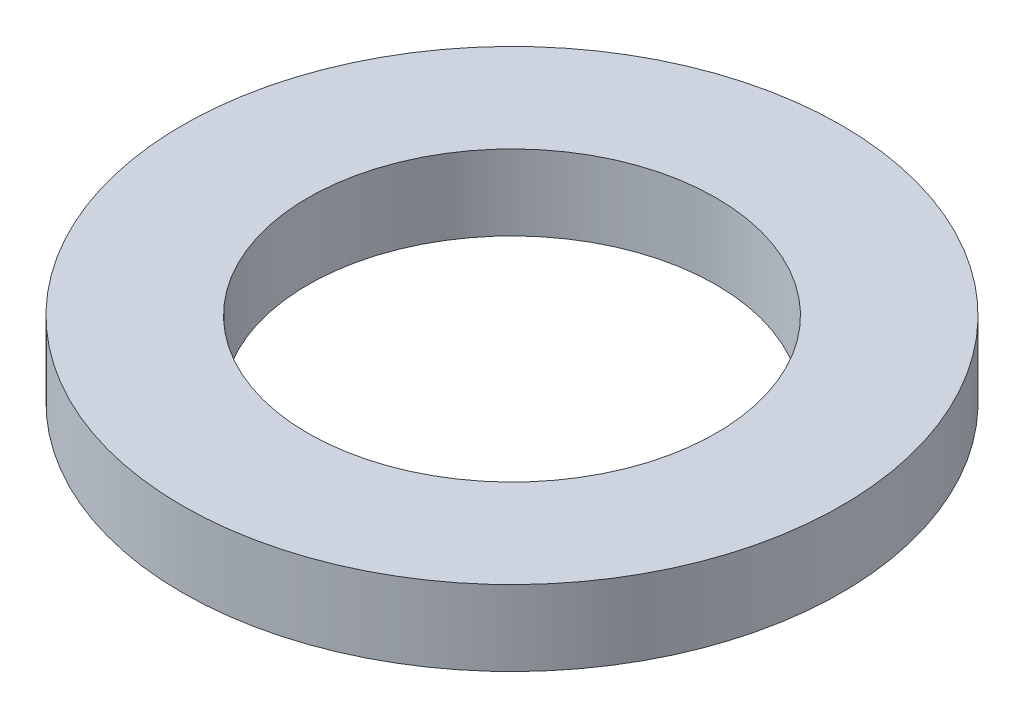
ISO-10303-21;
HEADER;
FILE_DESCRIPTION(('STEP AP214'),'2;1');
FILE_NAME('part.step','',(''),(''),'','','');
FILE_SCHEMA(('AUTOMOTIVE_DESIGN { 1 0 10303 214 1 1 1 1 }'));
ENDSEC;
DATA;
#1=APPLICATION_CONTEXT('core data for automotive mechanical design processes');
#2=APPLICATION_PROTOCOL_DEFINITION('international standard','automotive_design',2000,#1);
#3=PRODUCT_CONTEXT('',#1,'mechanical');
#4=PRODUCT('Part','Part','',(#3));
#5=PRODUCT_RELATED_PRODUCT_CATEGORY('part','',(#4));
#6=PRODUCT_DEFINITION_FORMATION('','',#4);
#7=PRODUCT_DEFINITION_CONTEXT('part definition',#1,'design');
#8=PRODUCT_DEFINITION('design','',#6,#7);
#9=PRODUCT_DEFINITION_SHAPE('','',#8);
#10=(LENGTH_UNIT() NAMED_UNIT(*) SI_UNIT(.MILLI.,.METRE.));
#11=(NAMED_UNIT(*) PLANE_ANGLE_UNIT() SI_UNIT($,.RADIAN.));
#12=(NAMED_UNIT(*) SI_UNIT($,.STERADIAN.) SOLID_ANGLE_UNIT());
#13=UNCERTAINTY_MEASURE_WITH_UNIT(LENGTH_MEASURE(1.E-05),#10,'distance_accuracy_value','');
#14=(GEOMETRIC_REPRESENTATION_CONTEXT(3) GLOBAL_UNCERTAINTY_ASSIGNED_CONTEXT((#13)) GLOBAL_UNIT_ASSIGNED_CONTEXT((#10,
#11,#12)) REPRESENTATION_CONTEXT('',''));
#15=CARTESIAN_POINT('',(0.,0.,0.));
#16=DIRECTION('',(0.,0.,1.));
#17=DIRECTION('',(1.,0.,0.));
#18=AXIS2_PLACEMENT_3D('',#15,#16,#17);
#19=CARTESIAN_POINT('',(0.,12.,0.));
#20=DIRECTION('',(0.,-1.,0.));
#21=DIRECTION('',(0.,0.,-1.));
#22=AXIS2_PLACEMENT_3D('',#19,#20,#21);
#23=CYLINDRICAL_SURFACE('',#22,52.5);
#24=CARTESIAN_POINT('',(0.,12.,0.));
#25=DIRECTION('',(0.,1.,0.));
#26=DIRECTION('',(0.,0.,1.));
#27=AXIS2_PLACEMENT_3D('',#24,#25,#26);
#28=CIRCLE('',#27,52.5);
#29=CARTESIAN_POINT('',(0.,12.,52.5));
#30=VERTEX_POINT('',#29);
#31=EDGE_CURVE('E10',#30,#30,#28,.T.);
#32=ORIENTED_EDGE('',*,*,#31,.F.);
#33=EDGE_LOOP('',(#32));
#34=FACE_BOUND('',#33,.T.);
#35=CARTESIAN_POINT('',(0.,0.,0.));
#36=DIRECTION('',(0.,1.,0.));
#37=DIRECTION('',(0.,0.,1.));
#38=AXIS2_PLACEMENT_3D('',#35,#36,#37);
#39=CIRCLE('',#38,52.5);
#40=CARTESIAN_POINT('',(0.,0.,52.5));
#41=VERTEX_POINT('',#40);
#42=EDGE_CURVE('E37',#41,#41,#39,.T.);
#43=ORIENTED_EDGE('',*,*,#42,.T.);
#44=EDGE_LOOP('',(#43));
#45=FACE_BOUND('',#44,.T.);
#46=ADVANCED_FACE('F40',(#34,#45),#23,.T.);
#47=CARTESIAN_POINT('',(0.,12.,0.));
#48=DIRECTION('',(0.,1.,0.));
#49=DIRECTION('',(0.,0.,1.));
#50=AXIS2_PLACEMENT_3D('',#47,#48,#49);
#51=PLANE('',#50);
#52=CARTESIAN_POINT('',(0.,12.,0.));
#53=DIRECTION('',(0.,1.,0.));
#54=DIRECTION('',(0.,0.,1.));
#55=AXIS2_PLACEMENT_3D('',#52,#53,#54);
#56=CIRCLE('',#55,32.5);
#57=CARTESIAN_POINT('',(0.,12.,32.5));
#58=VERTEX_POINT('',#57);
#59=EDGE_CURVE('E50',#58,#58,#56,.T.);
#60=ORIENTED_EDGE('',*,*,#59,.F.);
#61=EDGE_LOOP('',(#60));
#62=FACE_BOUND('',#61,.T.);
#63=ORIENTED_EDGE('',*,*,#31,.T.);
#64=EDGE_LOOP('',(#63));
#65=FACE_BOUND('',#64,.T.);
#66=ADVANCED_FACE('F59',(#62,#65),#51,.T.);
#67=CARTESIAN_POINT('',(0.,0.,0.));
#68=DIRECTION('',(0.,1.,0.));
#69=DIRECTION('',(0.,0.,1.));
#70=AXIS2_PLACEMENT_3D('',#67,#68,#69);
#71=PLANE('',#70);
#72=CARTESIAN_POINT('',(0.,0.,0.));
#73=DIRECTION('',(0.,1.,0.));
#74=DIRECTION('',(0.,0.,1.));
#75=AXIS2_PLACEMENT_3D('',#72,#73,#74);
#76=CIRCLE('',#75,32.5);
#77=CARTESIAN_POINT('',(0.,0.,32.5));
#78=VERTEX_POINT('',#77);
#79=EDGE_CURVE('E47',#78,#78,#76,.T.);
#80=ORIENTED_EDGE('',*,*,#79,.T.);
#81=EDGE_LOOP('',(#80));
#82=FACE_BOUND('',#81,.T.);
#83=ORIENTED_EDGE('',*,*,#42,.F.);
#84=EDGE_LOOP('',(#83));
#85=FACE_BOUND('',#84,.T.);
#86=ADVANCED_FACE('F58',(#82,#85),#71,.F.);
#87=CARTESIAN_POINT('',(0.,12.,0.));
#88=DIRECTION('',(0.,-1.,0.));
#89=DIRECTION('',(0.,0.,-1.));
#90=AXIS2_PLACEMENT_3D('',#87,#88,#89);
#91=CYLINDRICAL_SURFACE('',#90,32.5);
#92=ORIENTED_EDGE('',*,*,#59,.T.);
#93=EDGE_LOOP('',(#92));
#94=FACE_BOUND('',#93,.T.);
#95=ORIENTED_EDGE('',*,*,#79,.F.);
#96=EDGE_LOOP('',(#95));
#97=FACE_BOUND('',#96,.T.);
#98=ADVANCED_FACE('F54',(#94,#97),#91,.F.);
#99=CLOSED_SHELL('',(#46,#66,#86,#98));
#100=MANIFOLD_SOLID_BREP('B2',#99);
#101=ADVANCED_BREP_SHAPE_REPRESENTATION('',(#18,#100),#14);
#102=SHAPE_DEFINITION_REPRESENTATION(#9,#101);
ENDSEC;
END-ISO-10303-21;
